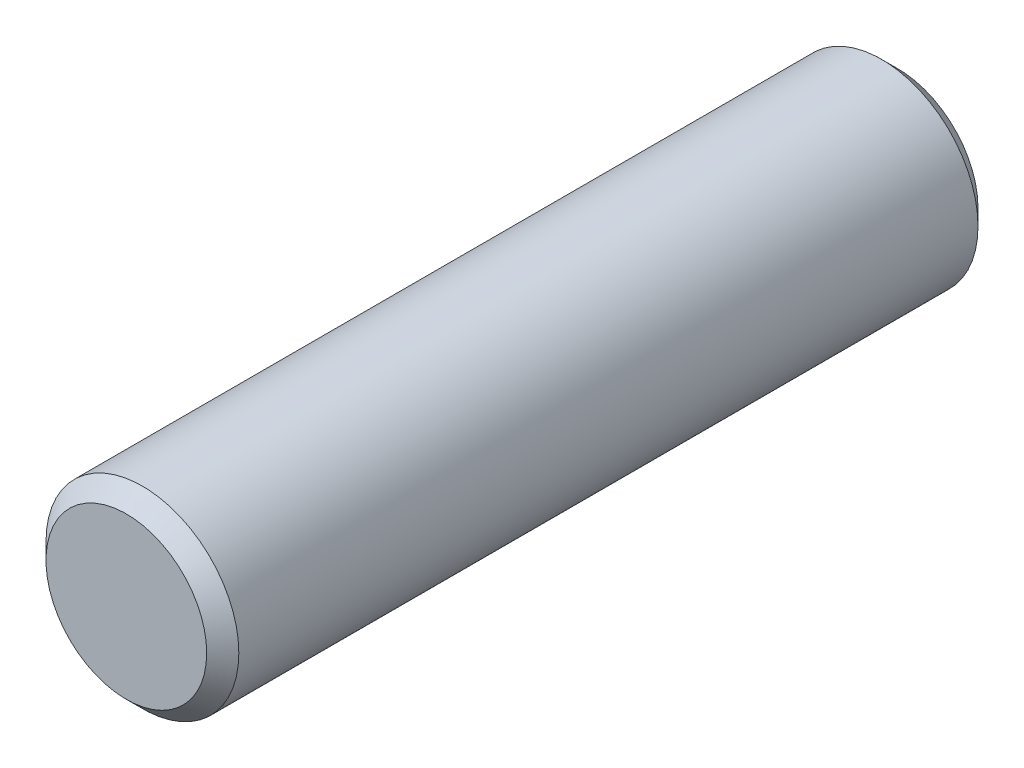
ISO-10303-21;
HEADER;
FILE_DESCRIPTION(('STEP AP214'),'2;1');
FILE_NAME('part.step','',(''),(''),'','','');
FILE_SCHEMA(('AUTOMOTIVE_DESIGN { 1 0 10303 214 1 1 1 1 }'));
ENDSEC;
DATA;
#1=APPLICATION_CONTEXT('core data for automotive mechanical design processes');
#2=APPLICATION_PROTOCOL_DEFINITION('international standard','automotive_design',2000,#1);
#3=PRODUCT_CONTEXT('',#1,'mechanical');
#4=PRODUCT('Part','Part','',(#3));
#5=PRODUCT_RELATED_PRODUCT_CATEGORY('part','',(#4));
#6=PRODUCT_DEFINITION_FORMATION('','',#4);
#7=PRODUCT_DEFINITION_CONTEXT('part definition',#1,'design');
#8=PRODUCT_DEFINITION('design','',#6,#7);
#9=PRODUCT_DEFINITION_SHAPE('','',#8);
#10=(LENGTH_UNIT() NAMED_UNIT(*) SI_UNIT(.MILLI.,.METRE.));
#11=(NAMED_UNIT(*) PLANE_ANGLE_UNIT() SI_UNIT($,.RADIAN.));
#12=(NAMED_UNIT(*) SI_UNIT($,.STERADIAN.) SOLID_ANGLE_UNIT());
#13=UNCERTAINTY_MEASURE_WITH_UNIT(LENGTH_MEASURE(1.E-05),#10,'distance_accuracy_value','');
#14=(GEOMETRIC_REPRESENTATION_CONTEXT(3) GLOBAL_UNCERTAINTY_ASSIGNED_CONTEXT((#13)) GLOBAL_UNIT_ASSIGNED_CONTEXT((#10,
#11,#12)) REPRESENTATION_CONTEXT('',''));
#15=CARTESIAN_POINT('',(0.,0.,0.));
#16=DIRECTION('',(0.,0.,1.));
#17=DIRECTION('',(1.,0.,0.));
#18=AXIS2_PLACEMENT_3D('',#15,#16,#17);
#19=CARTESIAN_POINT('',(0.,0.,24.));
#20=DIRECTION('',(0.,0.,-1.));
#21=DIRECTION('',(-0.999999999999999,0.,0.));
#22=AXIS2_PLACEMENT_3D('',#19,#20,#21);
#23=CYLINDRICAL_SURFACE('',#22,3.);
#24=CARTESIAN_POINT('',(0.,0.,23.4999999999999));
#25=DIRECTION('',(0.,0.,1.));
#26=DIRECTION('',(0.999999999999999,0.,0.));
#27=AXIS2_PLACEMENT_3D('',#24,#25,#26);
#28=CIRCLE('',#27,3.);
#29=CARTESIAN_POINT('',(3.,0.,23.4999999999999));
#30=VERTEX_POINT('',#29);
#31=EDGE_CURVE('E34',#30,#30,#28,.F.);
#32=ORIENTED_EDGE('',*,*,#31,.T.);
#33=EDGE_LOOP('',(#32));
#34=FACE_BOUND('',#33,.T.);
#35=CARTESIAN_POINT('',(0.,0.,0.500000000000007));
#36=DIRECTION('',(0.,0.,1.));
#37=DIRECTION('',(0.999999999999999,0.,0.));
#38=AXIS2_PLACEMENT_3D('',#35,#36,#37);
#39=CIRCLE('',#38,3.);
#40=CARTESIAN_POINT('',(3.,0.,0.500000000000007));
#41=VERTEX_POINT('',#40);
#42=EDGE_CURVE('E38',#41,#41,#39,.T.);
#43=ORIENTED_EDGE('',*,*,#42,.T.);
#44=EDGE_LOOP('',(#43));
#45=FACE_BOUND('',#44,.T.);
#46=ADVANCED_FACE('F28',(#34,#45),#23,.T.);
#47=CARTESIAN_POINT('',(0.,0.,24.));
#48=DIRECTION('',(0.,0.,1.));
#49=DIRECTION('',(0.999999999999999,0.,0.));
#50=AXIS2_PLACEMENT_3D('',#47,#48,#49);
#51=PLANE('',#50);
#52=CARTESIAN_POINT('',(0.,0.,24.));
#53=DIRECTION('',(0.,0.,1.));
#54=DIRECTION('',(0.999999999999999,0.,0.));
#55=AXIS2_PLACEMENT_3D('',#52,#53,#54);
#56=CIRCLE('',#55,2.5);
#57=CARTESIAN_POINT('',(2.49999999999999,0.,24.));
#58=VERTEX_POINT('',#57);
#59=EDGE_CURVE('E42',#58,#58,#56,.T.);
#60=ORIENTED_EDGE('',*,*,#59,.T.);
#61=EDGE_LOOP('',(#60));
#62=FACE_BOUND('',#61,.T.);
#63=ADVANCED_FACE('F48',(#62),#51,.T.);
#64=CARTESIAN_POINT('',(0.,0.,0.));
#65=DIRECTION('',(0.,0.,1.));
#66=DIRECTION('',(0.999999999999999,0.,0.));
#67=AXIS2_PLACEMENT_3D('',#64,#65,#66);
#68=PLANE('',#67);
#69=CARTESIAN_POINT('',(0.,0.,0.));
#70=DIRECTION('',(0.,0.,1.));
#71=DIRECTION('',(0.999999999999999,0.,0.));
#72=AXIS2_PLACEMENT_3D('',#69,#70,#71);
#73=CIRCLE('',#72,2.5);
#74=CARTESIAN_POINT('',(2.49999999999999,0.,0.));
#75=VERTEX_POINT('',#74);
#76=EDGE_CURVE('E10',#75,#75,#73,.F.);
#77=ORIENTED_EDGE('',*,*,#76,.T.);
#78=EDGE_LOOP('',(#77));
#79=FACE_BOUND('',#78,.T.);
#80=ADVANCED_FACE('F53',(#79),#68,.F.);
#81=CARTESIAN_POINT('',(0.,0.,24.));
#82=DIRECTION('',(0.,0.,-1.));
#83=DIRECTION('',(-0.999999999999999,0.,0.));
#84=AXIS2_PLACEMENT_3D('',#81,#82,#83);
#85=CONICAL_SURFACE('',#84,2.5,0.785398163397445);
#86=ORIENTED_EDGE('',*,*,#31,.F.);
#87=EDGE_LOOP('',(#86));
#88=FACE_BOUND('',#87,.T.);
#89=ORIENTED_EDGE('',*,*,#59,.F.);
#90=EDGE_LOOP('',(#89));
#91=FACE_BOUND('',#90,.T.);
#92=ADVANCED_FACE('F50',(#88,#91),#85,.T.);
#93=CARTESIAN_POINT('',(0.,0.,0.500000000000007));
#94=DIRECTION('',(0.,0.,1.));
#95=DIRECTION('',(0.999999999999999,0.,0.));
#96=AXIS2_PLACEMENT_3D('',#93,#94,#95);
#97=CONICAL_SURFACE('',#96,3.,0.785398163397443);
#98=ORIENTED_EDGE('',*,*,#76,.F.);
#99=EDGE_LOOP('',(#98));
#100=FACE_BOUND('',#99,.T.);
#101=ORIENTED_EDGE('',*,*,#42,.F.);
#102=EDGE_LOOP('',(#101));
#103=FACE_BOUND('',#102,.T.);
#104=ADVANCED_FACE('F52',(#100,#103),#97,.T.);
#105=CLOSED_SHELL('',(#46,#63,#80,#92,#104));
#106=MANIFOLD_SOLID_BREP('B2',#105);
#107=ADVANCED_BREP_SHAPE_REPRESENTATION('',(#18,#106),#14);
#108=SHAPE_DEFINITION_REPRESENTATION(#9,#107);
ENDSEC;
END-ISO-10303-21;
